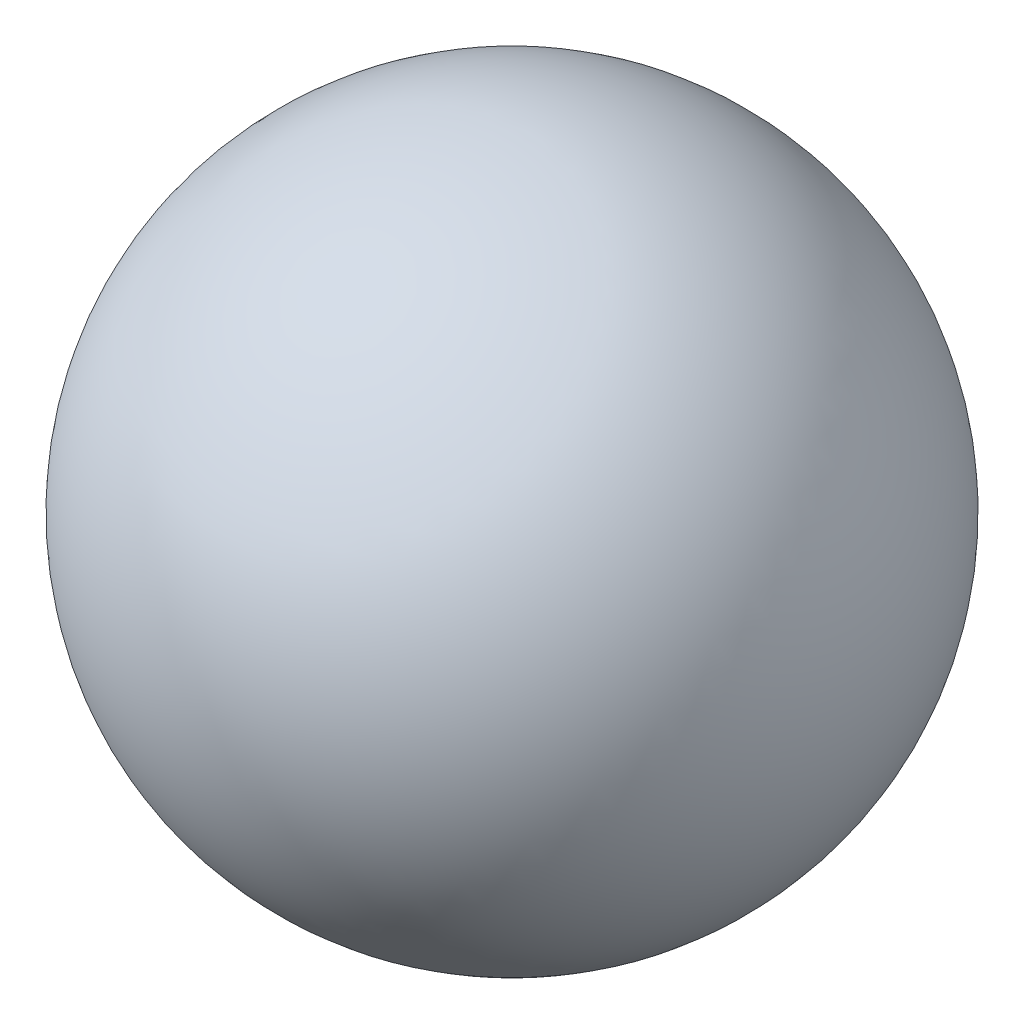
ISO-10303-21;
HEADER;
FILE_DESCRIPTION(('STEP AP214'),'2;1');
FILE_NAME('part.step','',(''),(''),'','','');
FILE_SCHEMA(('AUTOMOTIVE_DESIGN { 1 0 10303 214 1 1 1 1 }'));
ENDSEC;
DATA;
#1=APPLICATION_CONTEXT('core data for automotive mechanical design processes');
#2=APPLICATION_PROTOCOL_DEFINITION('international standard','automotive_design',2000,#1);
#3=PRODUCT_CONTEXT('',#1,'mechanical');
#4=PRODUCT('Part','Part','',(#3));
#5=PRODUCT_RELATED_PRODUCT_CATEGORY('part','',(#4));
#6=PRODUCT_DEFINITION_FORMATION('','',#4);
#7=PRODUCT_DEFINITION_CONTEXT('part definition',#1,'design');
#8=PRODUCT_DEFINITION('design','',#6,#7);
#9=PRODUCT_DEFINITION_SHAPE('','',#8);
#10=(LENGTH_UNIT() NAMED_UNIT(*) SI_UNIT(.MILLI.,.METRE.));
#11=(NAMED_UNIT(*) PLANE_ANGLE_UNIT() SI_UNIT($,.RADIAN.));
#12=(NAMED_UNIT(*) SI_UNIT($,.STERADIAN.) SOLID_ANGLE_UNIT());
#13=UNCERTAINTY_MEASURE_WITH_UNIT(LENGTH_MEASURE(1.E-05),#10,'distance_accuracy_value','');
#14=(GEOMETRIC_REPRESENTATION_CONTEXT(3) GLOBAL_UNCERTAINTY_ASSIGNED_CONTEXT((#13)) GLOBAL_UNIT_ASSIGNED_CONTEXT((#10,
#11,#12)) REPRESENTATION_CONTEXT('',''));
#15=CARTESIAN_POINT('',(0.,0.,0.));
#16=DIRECTION('',(0.,0.,1.));
#17=DIRECTION('',(1.,0.,0.));
#18=AXIS2_PLACEMENT_3D('',#15,#16,#17);
#19=CARTESIAN_POINT('',(0.,3.35,0.));
#20=DIRECTION('',(0.0436746395810799,0.997954029736576,0.0466934726700802));
#21=DIRECTION('',(-0.990820311528116,0.0372825196496607,0.129942771987905));
#22=AXIS2_PLACEMENT_3D('',#19,#20,#21);
#23=SPHERICAL_SURFACE('',#22,0.794);
#24=CARTESIAN_POINT('',(0.0346776638273774,4.14237549961084,0.0370746173000436));
#25=VERTEX_POINT('',#24);
#26=VERTEX_LOOP('',#25);
#27=FACE_BOUND('',#26,.T.);
#28=CARTESIAN_POINT('',(-0.0346776638273775,2.55762450038916,-0.0370746173000436));
#29=VERTEX_POINT('',#28);
#30=VERTEX_LOOP('',#29);
#31=FACE_BOUND('',#30,.T.);
#32=ADVANCED_FACE('F16',(#27,#31),#23,.T.);
#33=CLOSED_SHELL('',(#32));
#34=MANIFOLD_SOLID_BREP('B1',#33);
#35=ADVANCED_BREP_SHAPE_REPRESENTATION('',(#18,#34),#14);
#36=SHAPE_DEFINITION_REPRESENTATION(#9,#35);
ENDSEC;
END-ISO-10303-21;
